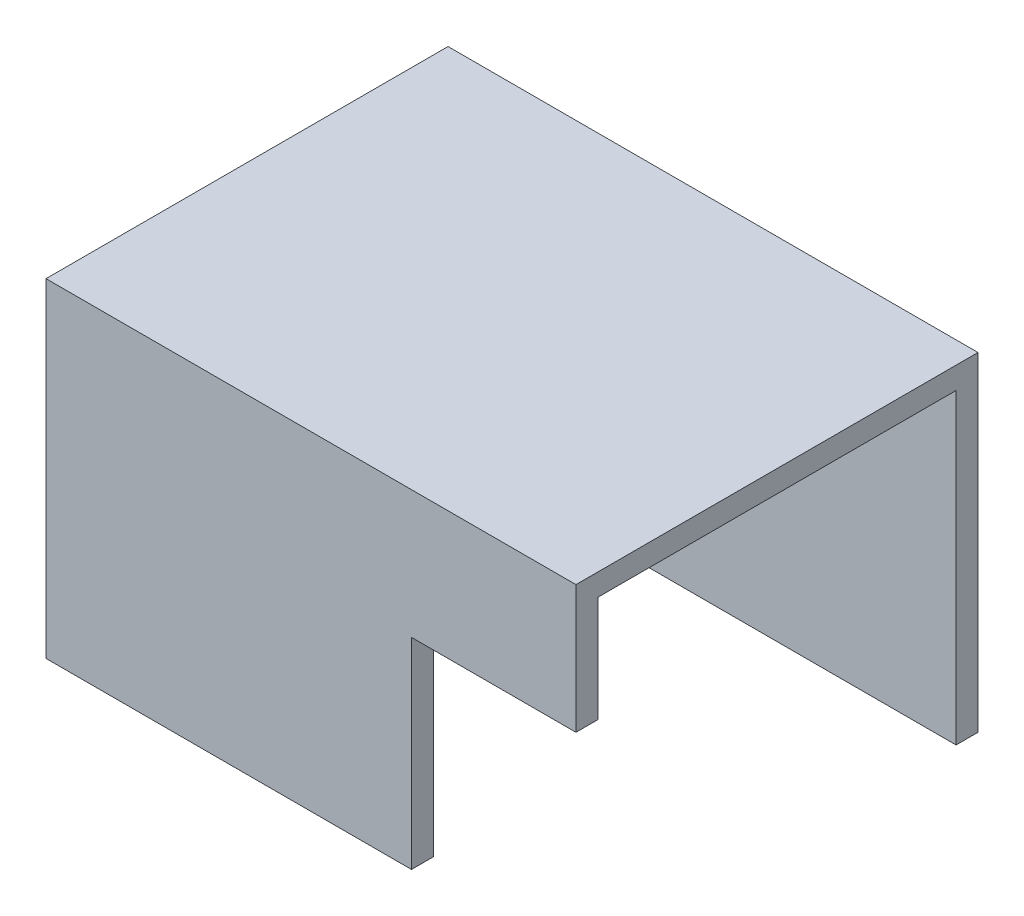
ISO-10303-21;
HEADER;
FILE_DESCRIPTION(('STEP AP214'),'2;1');
FILE_NAME('part.step','',(''),(''),'','','');
FILE_SCHEMA(('AUTOMOTIVE_DESIGN { 1 0 10303 214 1 1 1 1 }'));
ENDSEC;
DATA;
#1=APPLICATION_CONTEXT('core data for automotive mechanical design processes');
#2=APPLICATION_PROTOCOL_DEFINITION('international standard','automotive_design',2000,#1);
#3=PRODUCT_CONTEXT('',#1,'mechanical');
#4=PRODUCT('Part','Part','',(#3));
#5=PRODUCT_RELATED_PRODUCT_CATEGORY('part','',(#4));
#6=PRODUCT_DEFINITION_FORMATION('','',#4);
#7=PRODUCT_DEFINITION_CONTEXT('part definition',#1,'design');
#8=PRODUCT_DEFINITION('design','',#6,#7);
#9=PRODUCT_DEFINITION_SHAPE('','',#8);
#10=(LENGTH_UNIT() NAMED_UNIT(*) SI_UNIT(.MILLI.,.METRE.));
#11=(NAMED_UNIT(*) PLANE_ANGLE_UNIT() SI_UNIT($,.RADIAN.));
#12=(NAMED_UNIT(*) SI_UNIT($,.STERADIAN.) SOLID_ANGLE_UNIT());
#13=UNCERTAINTY_MEASURE_WITH_UNIT(LENGTH_MEASURE(1.E-05),#10,'distance_accuracy_value','');
#14=(GEOMETRIC_REPRESENTATION_CONTEXT(3) GLOBAL_UNCERTAINTY_ASSIGNED_CONTEXT((#13)) GLOBAL_UNIT_ASSIGNED_CONTEXT((#10,
#11,#12)) REPRESENTATION_CONTEXT('',''));
#15=CARTESIAN_POINT('',(0.,0.,0.));
#16=DIRECTION('',(0.,0.,1.));
#17=DIRECTION('',(1.,0.,0.));
#18=AXIS2_PLACEMENT_3D('',#15,#16,#17);
#19=CARTESIAN_POINT('',(2.25,1.695,0.));
#20=DIRECTION('',(0.,-1.,0.));
#21=DIRECTION('',(0.707106781186548,0.,0.707106781186548));
#22=AXIS2_PLACEMENT_3D('',#19,#20,#21);
#23=PLANE('',#22);
#24=DIRECTION('',(0.,0.,1.));
#25=VECTOR('',#24,1.);
#26=CARTESIAN_POINT('',(2.975,1.695,0.03));
#27=LINE('',#26,#25);
#28=CARTESIAN_POINT('',(2.975,1.695,0.03));
#29=VERTEX_POINT('',#28);
#30=CARTESIAN_POINT('',(2.975,1.695,0.52));
#31=VERTEX_POINT('',#30);
#32=EDGE_CURVE('E11',#29,#31,#27,.T.);
#33=ORIENTED_EDGE('',*,*,#32,.T.);
#34=DIRECTION('',(1.,0.,0.));
#35=VECTOR('',#34,1.);
#36=CARTESIAN_POINT('',(2.25,1.695,0.52));
#37=LINE('',#36,#35);
#38=CARTESIAN_POINT('',(2.25,1.695,0.52));
#39=VERTEX_POINT('',#38);
#40=EDGE_CURVE('E35',#39,#31,#37,.T.);
#41=ORIENTED_EDGE('',*,*,#40,.F.);
#42=DIRECTION('',(0.,0.,1.));
#43=VECTOR('',#42,1.);
#44=CARTESIAN_POINT('',(2.25,1.695,0.03));
#45=LINE('',#44,#43);
#46=CARTESIAN_POINT('',(2.25,1.695,0.03));
#47=VERTEX_POINT('',#46);
#48=EDGE_CURVE('E164',#47,#39,#45,.T.);
#49=ORIENTED_EDGE('',*,*,#48,.F.);
#50=DIRECTION('',(1.,0.,0.));
#51=VECTOR('',#50,1.);
#52=CARTESIAN_POINT('',(2.25,1.695,0.03));
#53=LINE('',#52,#51);
#54=EDGE_CURVE('E26',#47,#29,#53,.T.);
#55=ORIENTED_EDGE('',*,*,#54,.T.);
#56=EDGE_LOOP('',(#33,#41,#49,#55));
#57=FACE_BOUND('',#56,.T.);
#58=ADVANCED_FACE('F16',(#57),#23,.T.);
#59=CARTESIAN_POINT('',(2.975,0.,0.));
#60=DIRECTION('',(-1.,0.,0.));
#61=DIRECTION('',(0.,0.707106781186548,0.707106781186548));
#62=AXIS2_PLACEMENT_3D('',#59,#60,#61);
#63=PLANE('',#62);
#64=DIRECTION('',(0.,0.,-1.));
#65=VECTOR('',#64,1.);
#66=CARTESIAN_POINT('',(2.975,1.725,0.55));
#67=LINE('',#66,#65);
#68=CARTESIAN_POINT('',(2.975,1.725,0.55));
#69=VERTEX_POINT('',#68);
#70=CARTESIAN_POINT('',(2.975,1.725,0.));
#71=VERTEX_POINT('',#70);
#72=EDGE_CURVE('E110',#69,#71,#67,.T.);
#73=ORIENTED_EDGE('',*,*,#72,.F.);
#74=DIRECTION('',(0.,1.,0.));
#75=VECTOR('',#74,1.);
#76=CARTESIAN_POINT('',(2.975,1.55,0.55));
#77=LINE('',#76,#75);
#78=CARTESIAN_POINT('',(2.975,1.55,0.55));
#79=VERTEX_POINT('',#78);
#80=EDGE_CURVE('E111',#79,#69,#77,.T.);
#81=ORIENTED_EDGE('',*,*,#80,.F.);
#82=DIRECTION('',(0.,0.,1.));
#83=VECTOR('',#82,1.);
#84=CARTESIAN_POINT('',(2.975,1.55,0.52));
#85=LINE('',#84,#83);
#86=CARTESIAN_POINT('',(2.975,1.55,0.52));
#87=VERTEX_POINT('',#86);
#88=EDGE_CURVE('E108',#87,#79,#85,.T.);
#89=ORIENTED_EDGE('',*,*,#88,.F.);
#90=DIRECTION('',(0.,-1.,0.));
#91=VECTOR('',#90,1.);
#92=CARTESIAN_POINT('',(2.975,1.695,0.52));
#93=LINE('',#92,#91);
#94=EDGE_CURVE('E158',#31,#87,#93,.T.);
#95=ORIENTED_EDGE('',*,*,#94,.F.);
#96=ORIENTED_EDGE('',*,*,#32,.F.);
#97=DIRECTION('',(0.,1.,0.));
#98=VECTOR('',#97,1.);
#99=CARTESIAN_POINT('',(2.975,1.275,0.03));
#100=LINE('',#99,#98);
#101=CARTESIAN_POINT('',(2.975,1.275,0.03));
#102=VERTEX_POINT('',#101);
#103=EDGE_CURVE('E139',#102,#29,#100,.T.);
#104=ORIENTED_EDGE('',*,*,#103,.F.);
#105=DIRECTION('',(0.,0.,1.));
#106=VECTOR('',#105,1.);
#107=CARTESIAN_POINT('',(2.975,1.275,0.));
#108=LINE('',#107,#106);
#109=CARTESIAN_POINT('',(2.975,1.275,0.));
#110=VERTEX_POINT('',#109);
#111=EDGE_CURVE('E143',#110,#102,#108,.T.);
#112=ORIENTED_EDGE('',*,*,#111,.F.);
#113=DIRECTION('',(0.,-1.,0.));
#114=VECTOR('',#113,1.);
#115=CARTESIAN_POINT('',(2.975,1.725,0.));
#116=LINE('',#115,#114);
#117=EDGE_CURVE('E120',#71,#110,#116,.T.);
#118=ORIENTED_EDGE('',*,*,#117,.F.);
#119=EDGE_LOOP('',(#73,#81,#89,#95,#96,#104,#112,#118));
#120=FACE_BOUND('',#119,.T.);
#121=ADVANCED_FACE('F194',(#120),#63,.F.);
#122=CARTESIAN_POINT('',(2.6,0.,0.52));
#123=DIRECTION('',(0.,0.,-1.));
#124=DIRECTION('',(0.707106781186548,0.707106781186548,0.));
#125=AXIS2_PLACEMENT_3D('',#122,#123,#124);
#126=PLANE('',#125);
#127=ORIENTED_EDGE('',*,*,#94,.T.);
#128=DIRECTION('',(1.,0.,0.));
#129=VECTOR('',#128,1.);
#130=CARTESIAN_POINT('',(2.75,1.55,0.52));
#131=LINE('',#130,#129);
#132=CARTESIAN_POINT('',(2.75,1.55,0.52));
#133=VERTEX_POINT('',#132);
#134=EDGE_CURVE('E157',#133,#87,#131,.T.);
#135=ORIENTED_EDGE('',*,*,#134,.F.);
#136=DIRECTION('',(0.,-1.,0.));
#137=VECTOR('',#136,1.);
#138=CARTESIAN_POINT('',(2.75,1.55,0.52));
#139=LINE('',#138,#137);
#140=CARTESIAN_POINT('',(2.75,1.275,0.52));
#141=VERTEX_POINT('',#140);
#142=EDGE_CURVE('E116',#133,#141,#139,.T.);
#143=ORIENTED_EDGE('',*,*,#142,.T.);
#144=DIRECTION('',(-1.,0.,0.));
#145=VECTOR('',#144,1.);
#146=CARTESIAN_POINT('',(2.75,1.275,0.52));
#147=LINE('',#146,#145);
#148=CARTESIAN_POINT('',(2.25,1.275,0.52));
#149=VERTEX_POINT('',#148);
#150=EDGE_CURVE('E153',#141,#149,#147,.T.);
#151=ORIENTED_EDGE('',*,*,#150,.T.);
#152=DIRECTION('',(0.,1.,0.));
#153=VECTOR('',#152,1.);
#154=CARTESIAN_POINT('',(2.25,1.275,0.52));
#155=LINE('',#154,#153);
#156=EDGE_CURVE('E154',#149,#39,#155,.T.);
#157=ORIENTED_EDGE('',*,*,#156,.T.);
#158=ORIENTED_EDGE('',*,*,#40,.T.);
#159=EDGE_LOOP('',(#127,#135,#143,#151,#157,#158));
#160=FACE_BOUND('',#159,.T.);
#161=ADVANCED_FACE('F156',(#160),#126,.T.);
#162=CARTESIAN_POINT('',(2.25,1.275,0.));
#163=DIRECTION('',(1.,0.,0.));
#164=DIRECTION('',(0.,0.707106781186548,0.707106781186548));
#165=AXIS2_PLACEMENT_3D('',#162,#163,#164);
#166=PLANE('',#165);
#167=ORIENTED_EDGE('',*,*,#48,.T.);
#168=ORIENTED_EDGE('',*,*,#156,.F.);
#169=DIRECTION('',(0.,0.,1.));
#170=VECTOR('',#169,1.);
#171=CARTESIAN_POINT('',(2.25,1.275,0.52));
#172=LINE('',#171,#170);
#173=CARTESIAN_POINT('',(2.25,1.275,0.55));
#174=VERTEX_POINT('',#173);
#175=EDGE_CURVE('E151',#149,#174,#172,.T.);
#176=ORIENTED_EDGE('',*,*,#175,.T.);
#177=DIRECTION('',(0.,1.,0.));
#178=VECTOR('',#177,1.);
#179=CARTESIAN_POINT('',(2.25,1.275,0.55));
#180=LINE('',#179,#178);
#181=CARTESIAN_POINT('',(2.25,1.725,0.55));
#182=VERTEX_POINT('',#181);
#183=EDGE_CURVE('E135',#174,#182,#180,.T.);
#184=ORIENTED_EDGE('',*,*,#183,.T.);
#185=DIRECTION('',(0.,0.,1.));
#186=VECTOR('',#185,1.);
#187=CARTESIAN_POINT('',(2.25,1.725,0.));
#188=LINE('',#187,#186);
#189=CARTESIAN_POINT('',(2.25,1.725,0.));
#190=VERTEX_POINT('',#189);
#191=EDGE_CURVE('E130',#190,#182,#188,.T.);
#192=ORIENTED_EDGE('',*,*,#191,.F.);
#193=DIRECTION('',(0.,1.,0.));
#194=VECTOR('',#193,1.);
#195=CARTESIAN_POINT('',(2.25,1.275,0.));
#196=LINE('',#195,#194);
#197=CARTESIAN_POINT('',(2.25,1.275,0.));
#198=VERTEX_POINT('',#197);
#199=EDGE_CURVE('E101',#198,#190,#196,.T.);
#200=ORIENTED_EDGE('',*,*,#199,.F.);
#201=DIRECTION('',(0.,0.,1.));
#202=VECTOR('',#201,1.);
#203=CARTESIAN_POINT('',(2.25,1.275,0.));
#204=LINE('',#203,#202);
#205=CARTESIAN_POINT('',(2.25,1.275,0.03));
#206=VERTEX_POINT('',#205);
#207=EDGE_CURVE('E132',#198,#206,#204,.T.);
#208=ORIENTED_EDGE('',*,*,#207,.T.);
#209=DIRECTION('',(0.,1.,0.));
#210=VECTOR('',#209,1.);
#211=CARTESIAN_POINT('',(2.25,1.275,0.03));
#212=LINE('',#211,#210);
#213=EDGE_CURVE('E136',#206,#47,#212,.T.);
#214=ORIENTED_EDGE('',*,*,#213,.T.);
#215=EDGE_LOOP('',(#167,#168,#176,#184,#192,#200,#208,#214));
#216=FACE_BOUND('',#215,.T.);
#217=ADVANCED_FACE('F168',(#216),#166,.F.);
#218=CARTESIAN_POINT('',(2.6,0.,0.03));
#219=DIRECTION('',(0.,0.,-1.));
#220=DIRECTION('',(0.707106781186548,0.707106781186548,0.));
#221=AXIS2_PLACEMENT_3D('',#218,#219,#220);
#222=PLANE('',#221);
#223=DIRECTION('',(-1.,0.,0.));
#224=VECTOR('',#223,1.);
#225=CARTESIAN_POINT('',(2.975,1.275,0.03));
#226=LINE('',#225,#224);
#227=EDGE_CURVE('E140',#102,#206,#226,.T.);
#228=ORIENTED_EDGE('',*,*,#227,.F.);
#229=ORIENTED_EDGE('',*,*,#103,.T.);
#230=ORIENTED_EDGE('',*,*,#54,.F.);
#231=ORIENTED_EDGE('',*,*,#213,.F.);
#232=EDGE_LOOP('',(#228,#229,#230,#231));
#233=FACE_BOUND('',#232,.T.);
#234=ADVANCED_FACE('F216',(#233),#222,.F.);
#235=CARTESIAN_POINT('',(2.25,1.725,0.));
#236=DIRECTION('',(0.,-1.,0.));
#237=DIRECTION('',(0.707106781186548,0.,0.707106781186548));
#238=AXIS2_PLACEMENT_3D('',#235,#236,#237);
#239=PLANE('',#238);
#240=ORIENTED_EDGE('',*,*,#191,.T.);
#241=DIRECTION('',(1.,0.,0.));
#242=VECTOR('',#241,1.);
#243=CARTESIAN_POINT('',(2.25,1.725,0.55));
#244=LINE('',#243,#242);
#245=EDGE_CURVE('E144',#182,#69,#244,.T.);
#246=ORIENTED_EDGE('',*,*,#245,.T.);
#247=ORIENTED_EDGE('',*,*,#72,.T.);
#248=DIRECTION('',(1.,0.,0.));
#249=VECTOR('',#248,1.);
#250=CARTESIAN_POINT('',(2.25,1.725,0.));
#251=LINE('',#250,#249);
#252=EDGE_CURVE('E123',#190,#71,#251,.T.);
#253=ORIENTED_EDGE('',*,*,#252,.F.);
#254=EDGE_LOOP('',(#240,#246,#247,#253));
#255=FACE_BOUND('',#254,.T.);
#256=ADVANCED_FACE('F173',(#255),#239,.F.);
#257=CARTESIAN_POINT('',(2.6,0.,0.55));
#258=DIRECTION('',(0.,0.,-1.));
#259=DIRECTION('',(0.707106781186548,0.707106781186548,0.));
#260=AXIS2_PLACEMENT_3D('',#257,#258,#259);
#261=PLANE('',#260);
#262=ORIENTED_EDGE('',*,*,#183,.F.);
#263=DIRECTION('',(-1.,0.,0.));
#264=VECTOR('',#263,1.);
#265=CARTESIAN_POINT('',(2.75,1.275,0.55));
#266=LINE('',#265,#264);
#267=CARTESIAN_POINT('',(2.75,1.275,0.55));
#268=VERTEX_POINT('',#267);
#269=EDGE_CURVE('E90',#268,#174,#266,.T.);
#270=ORIENTED_EDGE('',*,*,#269,.F.);
#271=DIRECTION('',(0.,-1.,0.));
#272=VECTOR('',#271,1.);
#273=CARTESIAN_POINT('',(2.75,1.55,0.55));
#274=LINE('',#273,#272);
#275=CARTESIAN_POINT('',(2.75,1.55,0.55));
#276=VERTEX_POINT('',#275);
#277=EDGE_CURVE('E93',#276,#268,#274,.T.);
#278=ORIENTED_EDGE('',*,*,#277,.F.);
#279=DIRECTION('',(1.,0.,0.));
#280=VECTOR('',#279,1.);
#281=CARTESIAN_POINT('',(2.75,1.55,0.55));
#282=LINE('',#281,#280);
#283=EDGE_CURVE('E96',#276,#79,#282,.T.);
#284=ORIENTED_EDGE('',*,*,#283,.T.);
#285=ORIENTED_EDGE('',*,*,#80,.T.);
#286=ORIENTED_EDGE('',*,*,#245,.F.);
#287=EDGE_LOOP('',(#262,#270,#278,#284,#285,#286));
#288=FACE_BOUND('',#287,.T.);
#289=ADVANCED_FACE('F95',(#288),#261,.F.);
#290=CARTESIAN_POINT('',(2.75,1.55,0.52));
#291=DIRECTION('',(0.,1.,0.));
#292=DIRECTION('',(0.707106781186548,0.,0.707106781186548));
#293=AXIS2_PLACEMENT_3D('',#290,#291,#292);
#294=PLANE('',#293);
#295=ORIENTED_EDGE('',*,*,#134,.T.);
#296=ORIENTED_EDGE('',*,*,#88,.T.);
#297=ORIENTED_EDGE('',*,*,#283,.F.);
#298=DIRECTION('',(0.,0.,1.));
#299=VECTOR('',#298,1.);
#300=CARTESIAN_POINT('',(2.75,1.55,0.52));
#301=LINE('',#300,#299);
#302=EDGE_CURVE('E102',#133,#276,#301,.T.);
#303=ORIENTED_EDGE('',*,*,#302,.F.);
#304=EDGE_LOOP('',(#295,#296,#297,#303));
#305=FACE_BOUND('',#304,.T.);
#306=ADVANCED_FACE('F107',(#305),#294,.F.);
#307=CARTESIAN_POINT('',(2.75,1.275,0.));
#308=DIRECTION('',(0.,1.,0.));
#309=DIRECTION('',(0.707106781186548,0.,0.707106781186548));
#310=AXIS2_PLACEMENT_3D('',#307,#308,#309);
#311=PLANE('',#310);
#312=ORIENTED_EDGE('',*,*,#207,.F.);
#313=DIRECTION('',(-1.,0.,0.));
#314=VECTOR('',#313,1.);
#315=CARTESIAN_POINT('',(2.975,1.275,0.));
#316=LINE('',#315,#314);
#317=EDGE_CURVE('E118',#110,#198,#316,.T.);
#318=ORIENTED_EDGE('',*,*,#317,.F.);
#319=ORIENTED_EDGE('',*,*,#111,.T.);
#320=ORIENTED_EDGE('',*,*,#227,.T.);
#321=EDGE_LOOP('',(#312,#318,#319,#320));
#322=FACE_BOUND('',#321,.T.);
#323=ADVANCED_FACE('F197',(#322),#311,.F.);
#324=CARTESIAN_POINT('',(2.6,0.,0.));
#325=DIRECTION('',(0.,0.,-1.));
#326=DIRECTION('',(0.707106781186548,0.707106781186548,0.));
#327=AXIS2_PLACEMENT_3D('',#324,#325,#326);
#328=PLANE('',#327);
#329=ORIENTED_EDGE('',*,*,#252,.T.);
#330=ORIENTED_EDGE('',*,*,#117,.T.);
#331=ORIENTED_EDGE('',*,*,#317,.T.);
#332=ORIENTED_EDGE('',*,*,#199,.T.);
#333=EDGE_LOOP('',(#329,#330,#331,#332));
#334=FACE_BOUND('',#333,.T.);
#335=ADVANCED_FACE('F195',(#334),#328,.T.);
#336=CARTESIAN_POINT('',(2.75,1.725,0.));
#337=DIRECTION('',(-1.,0.,0.));
#338=DIRECTION('',(0.,0.707106781186548,0.707106781186548));
#339=AXIS2_PLACEMENT_3D('',#336,#337,#338);
#340=PLANE('',#339);
#341=ORIENTED_EDGE('',*,*,#277,.T.);
#342=DIRECTION('',(0.,0.,1.));
#343=VECTOR('',#342,1.);
#344=CARTESIAN_POINT('',(2.75,1.275,0.52));
#345=LINE('',#344,#343);
#346=EDGE_CURVE('E20',#141,#268,#345,.T.);
#347=ORIENTED_EDGE('',*,*,#346,.F.);
#348=ORIENTED_EDGE('',*,*,#142,.F.);
#349=ORIENTED_EDGE('',*,*,#302,.T.);
#350=EDGE_LOOP('',(#341,#347,#348,#349));
#351=FACE_BOUND('',#350,.T.);
#352=ADVANCED_FACE('F114',(#351),#340,.F.);
#353=CARTESIAN_POINT('',(2.75,1.275,0.));
#354=DIRECTION('',(0.,1.,0.));
#355=DIRECTION('',(0.707106781186548,0.,0.707106781186548));
#356=AXIS2_PLACEMENT_3D('',#353,#354,#355);
#357=PLANE('',#356);
#358=ORIENTED_EDGE('',*,*,#346,.T.);
#359=ORIENTED_EDGE('',*,*,#269,.T.);
#360=ORIENTED_EDGE('',*,*,#175,.F.);
#361=ORIENTED_EDGE('',*,*,#150,.F.);
#362=EDGE_LOOP('',(#358,#359,#360,#361));
#363=FACE_BOUND('',#362,.T.);
#364=ADVANCED_FACE('F18',(#363),#357,.F.);
#365=CLOSED_SHELL('',(#58,#121,#161,#217,#234,#256,#289,#306,#323,#335,#352,#364));
#366=MANIFOLD_SOLID_BREP('B1',#365);
#367=ADVANCED_BREP_SHAPE_REPRESENTATION('',(#18,#366),#14);
#368=SHAPE_DEFINITION_REPRESENTATION(#9,#367);
ENDSEC;
END-ISO-10303-21;
